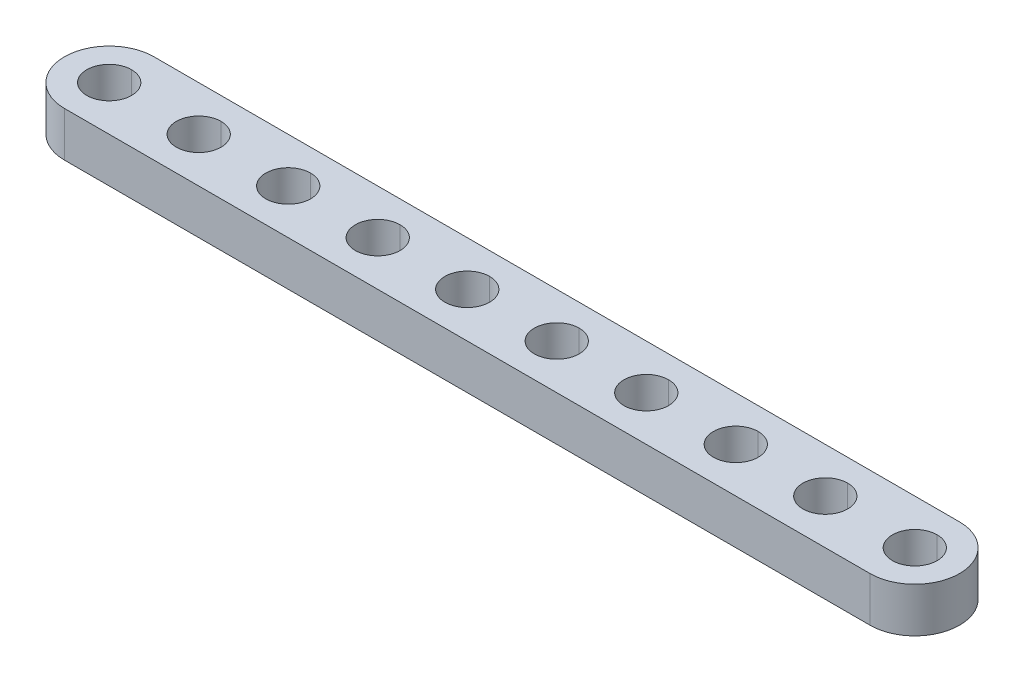
ISO-10303-21;
HEADER;
FILE_DESCRIPTION(('STEP AP214'),'2;1');
FILE_NAME('part.step','',(''),(''),'','','');
FILE_SCHEMA(('AUTOMOTIVE_DESIGN { 1 0 10303 214 1 1 1 1 }'));
ENDSEC;
DATA;
#1=APPLICATION_CONTEXT('core data for automotive mechanical design processes');
#2=APPLICATION_PROTOCOL_DEFINITION('international standard','automotive_design',2000,#1);
#3=PRODUCT_CONTEXT('',#1,'mechanical');
#4=PRODUCT('Part','Part','',(#3));
#5=PRODUCT_RELATED_PRODUCT_CATEGORY('part','',(#4));
#6=PRODUCT_DEFINITION_FORMATION('','',#4);
#7=PRODUCT_DEFINITION_CONTEXT('part definition',#1,'design');
#8=PRODUCT_DEFINITION('design','',#6,#7);
#9=PRODUCT_DEFINITION_SHAPE('','',#8);
#10=(LENGTH_UNIT() NAMED_UNIT(*) SI_UNIT(.MILLI.,.METRE.));
#11=(NAMED_UNIT(*) PLANE_ANGLE_UNIT() SI_UNIT($,.RADIAN.));
#12=(NAMED_UNIT(*) SI_UNIT($,.STERADIAN.) SOLID_ANGLE_UNIT());
#13=UNCERTAINTY_MEASURE_WITH_UNIT(LENGTH_MEASURE(1.E-05),#10,'distance_accuracy_value','');
#14=(GEOMETRIC_REPRESENTATION_CONTEXT(3) GLOBAL_UNCERTAINTY_ASSIGNED_CONTEXT((#13)) GLOBAL_UNIT_ASSIGNED_CONTEXT((#10,
#11,#12)) REPRESENTATION_CONTEXT('',''));
#15=CARTESIAN_POINT('',(0.,0.,0.));
#16=DIRECTION('',(0.,0.,1.));
#17=DIRECTION('',(1.,0.,0.));
#18=AXIS2_PLACEMENT_3D('',#15,#16,#17);
#19=CARTESIAN_POINT('',(36.,4.,0.));
#20=DIRECTION('',(0.,1.,0.));
#21=DIRECTION('',(0.,0.,1.));
#22=AXIS2_PLACEMENT_3D('',#19,#20,#21);
#23=CYLINDRICAL_SURFACE('',#22,2.);
#24=DIRECTION('',(0.,1.,0.));
#25=VECTOR('',#24,1.);
#26=CARTESIAN_POINT('',(36.,4.,-2.));
#27=LINE('',#26,#25);
#28=CARTESIAN_POINT('',(36.,0.,-2.));
#29=VERTEX_POINT('',#28);
#30=CARTESIAN_POINT('',(36.,4.,-2.));
#31=VERTEX_POINT('',#30);
#32=EDGE_CURVE('E172',#29,#31,#27,.T.);
#33=ORIENTED_EDGE('',*,*,#32,.F.);
#34=CARTESIAN_POINT('',(36.,0.,0.));
#35=DIRECTION('',(0.,1.,0.));
#36=DIRECTION('',(0.,0.,1.));
#37=AXIS2_PLACEMENT_3D('',#34,#35,#36);
#38=CIRCLE('',#37,2.);
#39=CARTESIAN_POINT('',(36.,0.,2.));
#40=VERTEX_POINT('',#39);
#41=EDGE_CURVE('E158',#40,#29,#38,.T.);
#42=ORIENTED_EDGE('',*,*,#41,.F.);
#43=DIRECTION('',(0.,1.,0.));
#44=VECTOR('',#43,1.);
#45=CARTESIAN_POINT('',(36.,4.,2.));
#46=LINE('',#45,#44);
#47=CARTESIAN_POINT('',(36.,4.,2.));
#48=VERTEX_POINT('',#47);
#49=EDGE_CURVE('E182',#40,#48,#46,.T.);
#50=ORIENTED_EDGE('',*,*,#49,.T.);
#51=CARTESIAN_POINT('',(36.,4.,0.));
#52=DIRECTION('',(0.,1.,0.));
#53=DIRECTION('',(0.,0.,1.));
#54=AXIS2_PLACEMENT_3D('',#51,#52,#53);
#55=CIRCLE('',#54,2.);
#56=EDGE_CURVE('E174',#48,#31,#55,.T.);
#57=ORIENTED_EDGE('',*,*,#56,.T.);
#58=EDGE_LOOP('',(#33,#42,#50,#57));
#59=FACE_BOUND('',#58,.T.);
#60=ADVANCED_FACE('F15',(#59),#23,.F.);
#61=CARTESIAN_POINT('',(28.,4.,0.));
#62=DIRECTION('',(0.,1.,0.));
#63=DIRECTION('',(0.,0.,1.));
#64=AXIS2_PLACEMENT_3D('',#61,#62,#63);
#65=CYLINDRICAL_SURFACE('',#64,2.);
#66=DIRECTION('',(0.,1.,0.));
#67=VECTOR('',#66,1.);
#68=CARTESIAN_POINT('',(28.,4.,-2.));
#69=LINE('',#68,#67);
#70=CARTESIAN_POINT('',(28.,0.,-2.));
#71=VERTEX_POINT('',#70);
#72=CARTESIAN_POINT('',(28.,4.,-2.));
#73=VERTEX_POINT('',#72);
#74=EDGE_CURVE('E257',#71,#73,#69,.T.);
#75=ORIENTED_EDGE('',*,*,#74,.F.);
#76=CARTESIAN_POINT('',(28.,0.,0.));
#77=DIRECTION('',(0.,1.,0.));
#78=DIRECTION('',(0.,0.,1.));
#79=AXIS2_PLACEMENT_3D('',#76,#77,#78);
#80=CIRCLE('',#79,2.);
#81=CARTESIAN_POINT('',(28.,0.,2.));
#82=VERTEX_POINT('',#81);
#83=EDGE_CURVE('E168',#82,#71,#80,.T.);
#84=ORIENTED_EDGE('',*,*,#83,.F.);
#85=DIRECTION('',(0.,1.,0.));
#86=VECTOR('',#85,1.);
#87=CARTESIAN_POINT('',(28.,4.,2.));
#88=LINE('',#87,#86);
#89=CARTESIAN_POINT('',(28.,4.,2.));
#90=VERTEX_POINT('',#89);
#91=EDGE_CURVE('E350',#82,#90,#88,.T.);
#92=ORIENTED_EDGE('',*,*,#91,.T.);
#93=CARTESIAN_POINT('',(28.,4.,0.));
#94=DIRECTION('',(0.,1.,0.));
#95=DIRECTION('',(0.,0.,1.));
#96=AXIS2_PLACEMENT_3D('',#93,#94,#95);
#97=CIRCLE('',#96,2.);
#98=EDGE_CURVE('E313',#90,#73,#97,.T.);
#99=ORIENTED_EDGE('',*,*,#98,.T.);
#100=EDGE_LOOP('',(#75,#84,#92,#99));
#101=FACE_BOUND('',#100,.T.);
#102=ADVANCED_FACE('F720',(#101),#65,.F.);
#103=CARTESIAN_POINT('',(20.,4.,0.));
#104=DIRECTION('',(0.,1.,0.));
#105=DIRECTION('',(0.,0.,1.));
#106=AXIS2_PLACEMENT_3D('',#103,#104,#105);
#107=CYLINDRICAL_SURFACE('',#106,2.);
#108=DIRECTION('',(0.,1.,0.));
#109=VECTOR('',#108,1.);
#110=CARTESIAN_POINT('',(20.,4.,-2.));
#111=LINE('',#110,#109);
#112=CARTESIAN_POINT('',(20.,0.,-2.));
#113=VERTEX_POINT('',#112);
#114=CARTESIAN_POINT('',(20.,4.,-2.));
#115=VERTEX_POINT('',#114);
#116=EDGE_CURVE('E227',#113,#115,#111,.T.);
#117=ORIENTED_EDGE('',*,*,#116,.F.);
#118=CARTESIAN_POINT('',(20.,0.,0.));
#119=DIRECTION('',(0.,1.,0.));
#120=DIRECTION('',(0.,0.,1.));
#121=AXIS2_PLACEMENT_3D('',#118,#119,#120);
#122=CIRCLE('',#121,2.);
#123=CARTESIAN_POINT('',(20.,0.,2.));
#124=VERTEX_POINT('',#123);
#125=EDGE_CURVE('E274',#124,#113,#122,.T.);
#126=ORIENTED_EDGE('',*,*,#125,.F.);
#127=DIRECTION('',(0.,1.,0.));
#128=VECTOR('',#127,1.);
#129=CARTESIAN_POINT('',(20.,4.,2.));
#130=LINE('',#129,#128);
#131=CARTESIAN_POINT('',(20.,4.,2.));
#132=VERTEX_POINT('',#131);
#133=EDGE_CURVE('E242',#124,#132,#130,.T.);
#134=ORIENTED_EDGE('',*,*,#133,.T.);
#135=CARTESIAN_POINT('',(20.,4.,0.));
#136=DIRECTION('',(0.,1.,0.));
#137=DIRECTION('',(0.,0.,1.));
#138=AXIS2_PLACEMENT_3D('',#135,#136,#137);
#139=CIRCLE('',#138,2.);
#140=EDGE_CURVE('E310',#132,#115,#139,.T.);
#141=ORIENTED_EDGE('',*,*,#140,.T.);
#142=EDGE_LOOP('',(#117,#126,#134,#141));
#143=FACE_BOUND('',#142,.T.);
#144=ADVANCED_FACE('F716',(#143),#107,.F.);
#145=CARTESIAN_POINT('',(12.,4.,0.));
#146=DIRECTION('',(0.,1.,0.));
#147=DIRECTION('',(0.,0.,1.));
#148=AXIS2_PLACEMENT_3D('',#145,#146,#147);
#149=CYLINDRICAL_SURFACE('',#148,2.);
#150=DIRECTION('',(0.,1.,0.));
#151=VECTOR('',#150,1.);
#152=CARTESIAN_POINT('',(12.,4.,-2.));
#153=LINE('',#152,#151);
#154=CARTESIAN_POINT('',(12.,0.,-2.));
#155=VERTEX_POINT('',#154);
#156=CARTESIAN_POINT('',(12.,4.,-2.));
#157=VERTEX_POINT('',#156);
#158=EDGE_CURVE('E233',#155,#157,#153,.T.);
#159=ORIENTED_EDGE('',*,*,#158,.F.);
#160=CARTESIAN_POINT('',(12.,0.,0.));
#161=DIRECTION('',(0.,1.,0.));
#162=DIRECTION('',(0.,0.,1.));
#163=AXIS2_PLACEMENT_3D('',#160,#161,#162);
#164=CIRCLE('',#163,2.);
#165=CARTESIAN_POINT('',(12.,0.,2.));
#166=VERTEX_POINT('',#165);
#167=EDGE_CURVE('E237',#166,#155,#164,.T.);
#168=ORIENTED_EDGE('',*,*,#167,.F.);
#169=DIRECTION('',(0.,1.,0.));
#170=VECTOR('',#169,1.);
#171=CARTESIAN_POINT('',(12.,4.,2.));
#172=LINE('',#171,#170);
#173=CARTESIAN_POINT('',(12.,4.,2.));
#174=VERTEX_POINT('',#173);
#175=EDGE_CURVE('E232',#166,#174,#172,.T.);
#176=ORIENTED_EDGE('',*,*,#175,.T.);
#177=CARTESIAN_POINT('',(12.,4.,0.));
#178=DIRECTION('',(0.,1.,0.));
#179=DIRECTION('',(0.,0.,1.));
#180=AXIS2_PLACEMENT_3D('',#177,#178,#179);
#181=CIRCLE('',#180,2.);
#182=EDGE_CURVE('E303',#174,#157,#181,.T.);
#183=ORIENTED_EDGE('',*,*,#182,.T.);
#184=EDGE_LOOP('',(#159,#168,#176,#183));
#185=FACE_BOUND('',#184,.T.);
#186=ADVANCED_FACE('F704',(#185),#149,.F.);
#187=CARTESIAN_POINT('',(4.,4.,0.));
#188=DIRECTION('',(0.,1.,0.));
#189=DIRECTION('',(0.,0.,1.));
#190=AXIS2_PLACEMENT_3D('',#187,#188,#189);
#191=CYLINDRICAL_SURFACE('',#190,2.);
#192=DIRECTION('',(0.,1.,0.));
#193=VECTOR('',#192,1.);
#194=CARTESIAN_POINT('',(4.,4.,-2.));
#195=LINE('',#194,#193);
#196=CARTESIAN_POINT('',(4.,0.,-2.));
#197=VERTEX_POINT('',#196);
#198=CARTESIAN_POINT('',(4.,4.,-2.));
#199=VERTEX_POINT('',#198);
#200=EDGE_CURVE('E252',#197,#199,#195,.T.);
#201=ORIENTED_EDGE('',*,*,#200,.F.);
#202=CARTESIAN_POINT('',(4.,0.,0.));
#203=DIRECTION('',(0.,1.,0.));
#204=DIRECTION('',(0.,0.,1.));
#205=AXIS2_PLACEMENT_3D('',#202,#203,#204);
#206=CIRCLE('',#205,2.);
#207=CARTESIAN_POINT('',(4.,0.,2.));
#208=VERTEX_POINT('',#207);
#209=EDGE_CURVE('E105',#208,#197,#206,.T.);
#210=ORIENTED_EDGE('',*,*,#209,.F.);
#211=DIRECTION('',(0.,1.,0.));
#212=VECTOR('',#211,1.);
#213=CARTESIAN_POINT('',(4.,4.,2.));
#214=LINE('',#213,#212);
#215=CARTESIAN_POINT('',(4.,4.,2.));
#216=VERTEX_POINT('',#215);
#217=EDGE_CURVE('E251',#208,#216,#214,.T.);
#218=ORIENTED_EDGE('',*,*,#217,.T.);
#219=CARTESIAN_POINT('',(4.,4.,0.));
#220=DIRECTION('',(0.,1.,0.));
#221=DIRECTION('',(0.,0.,1.));
#222=AXIS2_PLACEMENT_3D('',#219,#220,#221);
#223=CIRCLE('',#222,2.);
#224=EDGE_CURVE('E94',#216,#199,#223,.T.);
#225=ORIENTED_EDGE('',*,*,#224,.T.);
#226=EDGE_LOOP('',(#201,#210,#218,#225));
#227=FACE_BOUND('',#226,.T.);
#228=ADVANCED_FACE('F700',(#227),#191,.F.);
#229=CARTESIAN_POINT('',(-4.,4.,0.));
#230=DIRECTION('',(0.,1.,0.));
#231=DIRECTION('',(0.,0.,1.));
#232=AXIS2_PLACEMENT_3D('',#229,#230,#231);
#233=CYLINDRICAL_SURFACE('',#232,2.);
#234=DIRECTION('',(0.,1.,0.));
#235=VECTOR('',#234,1.);
#236=CARTESIAN_POINT('',(-4.,4.,-2.));
#237=LINE('',#236,#235);
#238=CARTESIAN_POINT('',(-4.,0.,-2.));
#239=VERTEX_POINT('',#238);
#240=CARTESIAN_POINT('',(-4.,4.,-2.));
#241=VERTEX_POINT('',#240);
#242=EDGE_CURVE('E324',#239,#241,#237,.T.);
#243=ORIENTED_EDGE('',*,*,#242,.F.);
#244=CARTESIAN_POINT('',(-4.,0.,0.));
#245=DIRECTION('',(0.,1.,0.));
#246=DIRECTION('',(0.,0.,1.));
#247=AXIS2_PLACEMENT_3D('',#244,#245,#246);
#248=CIRCLE('',#247,2.);
#249=CARTESIAN_POINT('',(-4.,0.,2.));
#250=VERTEX_POINT('',#249);
#251=EDGE_CURVE('E236',#250,#239,#248,.T.);
#252=ORIENTED_EDGE('',*,*,#251,.F.);
#253=DIRECTION('',(0.,1.,0.));
#254=VECTOR('',#253,1.);
#255=CARTESIAN_POINT('',(-4.,4.,2.));
#256=LINE('',#255,#254);
#257=CARTESIAN_POINT('',(-4.,4.,2.));
#258=VERTEX_POINT('',#257);
#259=EDGE_CURVE('E263',#250,#258,#256,.T.);
#260=ORIENTED_EDGE('',*,*,#259,.T.);
#261=CARTESIAN_POINT('',(-4.,4.,0.));
#262=DIRECTION('',(0.,1.,0.));
#263=DIRECTION('',(0.,0.,1.));
#264=AXIS2_PLACEMENT_3D('',#261,#262,#263);
#265=CIRCLE('',#264,2.);
#266=EDGE_CURVE('E302',#258,#241,#265,.T.);
#267=ORIENTED_EDGE('',*,*,#266,.T.);
#268=EDGE_LOOP('',(#243,#252,#260,#267));
#269=FACE_BOUND('',#268,.T.);
#270=ADVANCED_FACE('F689',(#269),#233,.F.);
#271=CARTESIAN_POINT('',(-12.,4.,0.));
#272=DIRECTION('',(0.,1.,0.));
#273=DIRECTION('',(0.,0.,1.));
#274=AXIS2_PLACEMENT_3D('',#271,#272,#273);
#275=CYLINDRICAL_SURFACE('',#274,2.);
#276=DIRECTION('',(0.,1.,0.));
#277=VECTOR('',#276,1.);
#278=CARTESIAN_POINT('',(-12.,4.,-2.));
#279=LINE('',#278,#277);
#280=CARTESIAN_POINT('',(-12.,0.,-2.));
#281=VERTEX_POINT('',#280);
#282=CARTESIAN_POINT('',(-12.,4.,-2.));
#283=VERTEX_POINT('',#282);
#284=EDGE_CURVE('E213',#281,#283,#279,.T.);
#285=ORIENTED_EDGE('',*,*,#284,.F.);
#286=CARTESIAN_POINT('',(-12.,0.,0.));
#287=DIRECTION('',(0.,1.,0.));
#288=DIRECTION('',(0.,0.,1.));
#289=AXIS2_PLACEMENT_3D('',#286,#287,#288);
#290=CIRCLE('',#289,2.);
#291=CARTESIAN_POINT('',(-12.,0.,2.));
#292=VERTEX_POINT('',#291);
#293=EDGE_CURVE('E19',#292,#281,#290,.T.);
#294=ORIENTED_EDGE('',*,*,#293,.F.);
#295=DIRECTION('',(0.,1.,0.));
#296=VECTOR('',#295,1.);
#297=CARTESIAN_POINT('',(-12.,4.,2.));
#298=LINE('',#297,#296);
#299=CARTESIAN_POINT('',(-12.,4.,2.));
#300=VERTEX_POINT('',#299);
#301=EDGE_CURVE('E196',#292,#300,#298,.T.);
#302=ORIENTED_EDGE('',*,*,#301,.T.);
#303=CARTESIAN_POINT('',(-12.,4.,0.));
#304=DIRECTION('',(0.,1.,0.));
#305=DIRECTION('',(0.,0.,1.));
#306=AXIS2_PLACEMENT_3D('',#303,#304,#305);
#307=CIRCLE('',#306,2.);
#308=EDGE_CURVE('E354',#300,#283,#307,.T.);
#309=ORIENTED_EDGE('',*,*,#308,.T.);
#310=EDGE_LOOP('',(#285,#294,#302,#309));
#311=FACE_BOUND('',#310,.T.);
#312=ADVANCED_FACE('F685',(#311),#275,.F.);
#313=CARTESIAN_POINT('',(-20.,4.,0.));
#314=DIRECTION('',(0.,1.,0.));
#315=DIRECTION('',(0.,0.,1.));
#316=AXIS2_PLACEMENT_3D('',#313,#314,#315);
#317=CYLINDRICAL_SURFACE('',#316,2.);
#318=DIRECTION('',(0.,1.,0.));
#319=VECTOR('',#318,1.);
#320=CARTESIAN_POINT('',(-20.,4.,-2.));
#321=LINE('',#320,#319);
#322=CARTESIAN_POINT('',(-20.,0.,-2.));
#323=VERTEX_POINT('',#322);
#324=CARTESIAN_POINT('',(-20.,4.,-2.));
#325=VERTEX_POINT('',#324);
#326=EDGE_CURVE('E210',#323,#325,#321,.T.);
#327=ORIENTED_EDGE('',*,*,#326,.F.);
#328=CARTESIAN_POINT('',(-20.,0.,0.));
#329=DIRECTION('',(0.,1.,0.));
#330=DIRECTION('',(0.,0.,1.));
#331=AXIS2_PLACEMENT_3D('',#328,#329,#330);
#332=CIRCLE('',#331,2.);
#333=CARTESIAN_POINT('',(-20.,0.,2.));
#334=VERTEX_POINT('',#333);
#335=EDGE_CURVE('E556',#334,#323,#332,.T.);
#336=ORIENTED_EDGE('',*,*,#335,.F.);
#337=DIRECTION('',(0.,1.,0.));
#338=VECTOR('',#337,1.);
#339=CARTESIAN_POINT('',(-20.,4.,2.));
#340=LINE('',#339,#338);
#341=CARTESIAN_POINT('',(-20.,4.,2.));
#342=VERTEX_POINT('',#341);
#343=EDGE_CURVE('E195',#334,#342,#340,.T.);
#344=ORIENTED_EDGE('',*,*,#343,.T.);
#345=CARTESIAN_POINT('',(-20.,4.,0.));
#346=DIRECTION('',(0.,1.,0.));
#347=DIRECTION('',(0.,0.,1.));
#348=AXIS2_PLACEMENT_3D('',#345,#346,#347);
#349=CIRCLE('',#348,2.);
#350=EDGE_CURVE('E351',#342,#325,#349,.T.);
#351=ORIENTED_EDGE('',*,*,#350,.T.);
#352=EDGE_LOOP('',(#327,#336,#344,#351));
#353=FACE_BOUND('',#352,.T.);
#354=ADVANCED_FACE('F555',(#353),#317,.F.);
#355=CARTESIAN_POINT('',(-28.,4.,0.));
#356=DIRECTION('',(0.,1.,0.));
#357=DIRECTION('',(0.,0.,1.));
#358=AXIS2_PLACEMENT_3D('',#355,#356,#357);
#359=CYLINDRICAL_SURFACE('',#358,2.);
#360=DIRECTION('',(0.,1.,0.));
#361=VECTOR('',#360,1.);
#362=CARTESIAN_POINT('',(-28.,4.,-2.));
#363=LINE('',#362,#361);
#364=CARTESIAN_POINT('',(-28.,0.,-2.));
#365=VERTEX_POINT('',#364);
#366=CARTESIAN_POINT('',(-28.,4.,-2.));
#367=VERTEX_POINT('',#366);
#368=EDGE_CURVE('E194',#365,#367,#363,.T.);
#369=ORIENTED_EDGE('',*,*,#368,.F.);
#370=CARTESIAN_POINT('',(-28.,0.,0.));
#371=DIRECTION('',(0.,1.,0.));
#372=DIRECTION('',(0.,0.,1.));
#373=AXIS2_PLACEMENT_3D('',#370,#371,#372);
#374=CIRCLE('',#373,2.);
#375=CARTESIAN_POINT('',(-28.,0.,2.));
#376=VERTEX_POINT('',#375);
#377=EDGE_CURVE('E26',#376,#365,#374,.T.);
#378=ORIENTED_EDGE('',*,*,#377,.F.);
#379=DIRECTION('',(0.,1.,0.));
#380=VECTOR('',#379,1.);
#381=CARTESIAN_POINT('',(-28.,4.,2.));
#382=LINE('',#381,#380);
#383=CARTESIAN_POINT('',(-28.,4.,2.));
#384=VERTEX_POINT('',#383);
#385=EDGE_CURVE('E369',#376,#384,#382,.T.);
#386=ORIENTED_EDGE('',*,*,#385,.T.);
#387=CARTESIAN_POINT('',(-28.,4.,0.));
#388=DIRECTION('',(0.,1.,0.));
#389=DIRECTION('',(0.,0.,1.));
#390=AXIS2_PLACEMENT_3D('',#387,#388,#389);
#391=CIRCLE('',#390,2.);
#392=EDGE_CURVE('E281',#384,#367,#391,.T.);
#393=ORIENTED_EDGE('',*,*,#392,.T.);
#394=EDGE_LOOP('',(#369,#378,#386,#393));
#395=FACE_BOUND('',#394,.T.);
#396=ADVANCED_FACE('F733',(#395),#359,.F.);
#397=CARTESIAN_POINT('',(-36.,4.,0.));
#398=DIRECTION('',(0.,1.,0.));
#399=DIRECTION('',(0.,0.,1.));
#400=AXIS2_PLACEMENT_3D('',#397,#398,#399);
#401=CYLINDRICAL_SURFACE('',#400,2.);
#402=DIRECTION('',(0.,1.,0.));
#403=VECTOR('',#402,1.);
#404=CARTESIAN_POINT('',(-36.,4.,-2.));
#405=LINE('',#404,#403);
#406=CARTESIAN_POINT('',(-36.,0.,-2.));
#407=VERTEX_POINT('',#406);
#408=CARTESIAN_POINT('',(-36.,4.,-2.));
#409=VERTEX_POINT('',#408);
#410=EDGE_CURVE('E373',#407,#409,#405,.T.);
#411=ORIENTED_EDGE('',*,*,#410,.F.);
#412=CARTESIAN_POINT('',(-36.,0.,0.));
#413=DIRECTION('',(0.,1.,0.));
#414=DIRECTION('',(0.,0.,1.));
#415=AXIS2_PLACEMENT_3D('',#412,#413,#414);
#416=CIRCLE('',#415,2.);
#417=CARTESIAN_POINT('',(-36.,0.,2.));
#418=VERTEX_POINT('',#417);
#419=EDGE_CURVE('E10',#418,#407,#416,.T.);
#420=ORIENTED_EDGE('',*,*,#419,.F.);
#421=DIRECTION('',(0.,1.,0.));
#422=VECTOR('',#421,1.);
#423=CARTESIAN_POINT('',(-36.,4.,2.));
#424=LINE('',#423,#422);
#425=CARTESIAN_POINT('',(-36.,4.,2.));
#426=VERTEX_POINT('',#425);
#427=EDGE_CURVE('E360',#418,#426,#424,.T.);
#428=ORIENTED_EDGE('',*,*,#427,.T.);
#429=CARTESIAN_POINT('',(-36.,4.,0.));
#430=DIRECTION('',(0.,1.,0.));
#431=DIRECTION('',(0.,0.,1.));
#432=AXIS2_PLACEMENT_3D('',#429,#430,#431);
#433=CIRCLE('',#432,2.);
#434=EDGE_CURVE('E169',#426,#409,#433,.T.);
#435=ORIENTED_EDGE('',*,*,#434,.T.);
#436=EDGE_LOOP('',(#411,#420,#428,#435));
#437=FACE_BOUND('',#436,.T.);
#438=ADVANCED_FACE('F737',(#437),#401,.F.);
#439=CARTESIAN_POINT('',(-36.,0.,0.));
#440=DIRECTION('',(0.,1.,0.));
#441=DIRECTION('',(1.,0.,0.));
#442=AXIS2_PLACEMENT_3D('',#439,#440,#441);
#443=PLANE('',#442);
#444=ORIENTED_EDGE('',*,*,#419,.T.);
#445=CARTESIAN_POINT('',(-36.,0.,0.));
#446=DIRECTION('',(0.,1.,0.));
#447=DIRECTION('',(0.,0.,1.));
#448=AXIS2_PLACEMENT_3D('',#445,#446,#447);
#449=CIRCLE('',#448,2.);
#450=EDGE_CURVE('E377',#407,#418,#449,.T.);
#451=ORIENTED_EDGE('',*,*,#450,.T.);
#452=EDGE_LOOP('',(#444,#451));
#453=FACE_BOUND('',#452,.T.);
#454=ORIENTED_EDGE('',*,*,#377,.T.);
#455=CARTESIAN_POINT('',(-28.,0.,0.));
#456=DIRECTION('',(0.,1.,0.));
#457=DIRECTION('',(0.,0.,1.));
#458=AXIS2_PLACEMENT_3D('',#455,#456,#457);
#459=CIRCLE('',#458,2.);
#460=EDGE_CURVE('E192',#365,#376,#459,.T.);
#461=ORIENTED_EDGE('',*,*,#460,.T.);
#462=EDGE_LOOP('',(#454,#461));
#463=FACE_BOUND('',#462,.T.);
#464=ORIENTED_EDGE('',*,*,#335,.T.);
#465=CARTESIAN_POINT('',(-20.,0.,0.));
#466=DIRECTION('',(0.,1.,0.));
#467=DIRECTION('',(0.,0.,1.));
#468=AXIS2_PLACEMENT_3D('',#465,#466,#467);
#469=CIRCLE('',#468,2.);
#470=EDGE_CURVE('E199',#323,#334,#469,.T.);
#471=ORIENTED_EDGE('',*,*,#470,.T.);
#472=EDGE_LOOP('',(#464,#471));
#473=FACE_BOUND('',#472,.T.);
#474=ORIENTED_EDGE('',*,*,#293,.T.);
#475=CARTESIAN_POINT('',(-12.,0.,0.));
#476=DIRECTION('',(0.,1.,0.));
#477=DIRECTION('',(0.,0.,1.));
#478=AXIS2_PLACEMENT_3D('',#475,#476,#477);
#479=CIRCLE('',#478,2.);
#480=EDGE_CURVE('E223',#281,#292,#479,.T.);
#481=ORIENTED_EDGE('',*,*,#480,.T.);
#482=EDGE_LOOP('',(#474,#481));
#483=FACE_BOUND('',#482,.T.);
#484=ORIENTED_EDGE('',*,*,#251,.T.);
#485=CARTESIAN_POINT('',(-4.,0.,0.));
#486=DIRECTION('',(0.,1.,0.));
#487=DIRECTION('',(0.,0.,1.));
#488=AXIS2_PLACEMENT_3D('',#485,#486,#487);
#489=CIRCLE('',#488,2.);
#490=EDGE_CURVE('E328',#239,#250,#489,.T.);
#491=ORIENTED_EDGE('',*,*,#490,.T.);
#492=EDGE_LOOP('',(#484,#491));
#493=FACE_BOUND('',#492,.T.);
#494=ORIENTED_EDGE('',*,*,#209,.T.);
#495=CARTESIAN_POINT('',(4.,0.,0.));
#496=DIRECTION('',(0.,1.,0.));
#497=DIRECTION('',(0.,0.,1.));
#498=AXIS2_PLACEMENT_3D('',#495,#496,#497);
#499=CIRCLE('',#498,2.);
#500=EDGE_CURVE('E294',#197,#208,#499,.T.);
#501=ORIENTED_EDGE('',*,*,#500,.T.);
#502=EDGE_LOOP('',(#494,#501));
#503=FACE_BOUND('',#502,.T.);
#504=ORIENTED_EDGE('',*,*,#167,.T.);
#505=CARTESIAN_POINT('',(12.,0.,0.));
#506=DIRECTION('',(0.,1.,0.));
#507=DIRECTION('',(0.,0.,1.));
#508=AXIS2_PLACEMENT_3D('',#505,#506,#507);
#509=CIRCLE('',#508,2.);
#510=EDGE_CURVE('E243',#155,#166,#509,.T.);
#511=ORIENTED_EDGE('',*,*,#510,.T.);
#512=EDGE_LOOP('',(#504,#511));
#513=FACE_BOUND('',#512,.T.);
#514=ORIENTED_EDGE('',*,*,#125,.T.);
#515=CARTESIAN_POINT('',(20.,0.,0.));
#516=DIRECTION('',(0.,1.,0.));
#517=DIRECTION('',(0.,0.,1.));
#518=AXIS2_PLACEMENT_3D('',#515,#516,#517);
#519=CIRCLE('',#518,2.);
#520=EDGE_CURVE('E359',#113,#124,#519,.T.);
#521=ORIENTED_EDGE('',*,*,#520,.T.);
#522=EDGE_LOOP('',(#514,#521));
#523=FACE_BOUND('',#522,.T.);
#524=ORIENTED_EDGE('',*,*,#83,.T.);
#525=CARTESIAN_POINT('',(28.,0.,0.));
#526=DIRECTION('',(0.,1.,0.));
#527=DIRECTION('',(0.,0.,1.));
#528=AXIS2_PLACEMENT_3D('',#525,#526,#527);
#529=CIRCLE('',#528,2.);
#530=EDGE_CURVE('E262',#71,#82,#529,.T.);
#531=ORIENTED_EDGE('',*,*,#530,.T.);
#532=EDGE_LOOP('',(#524,#531));
#533=FACE_BOUND('',#532,.T.);
#534=ORIENTED_EDGE('',*,*,#41,.T.);
#535=CARTESIAN_POINT('',(36.,0.,0.));
#536=DIRECTION('',(0.,1.,0.));
#537=DIRECTION('',(0.,0.,1.));
#538=AXIS2_PLACEMENT_3D('',#535,#536,#537);
#539=CIRCLE('',#538,2.);
#540=EDGE_CURVE('E163',#29,#40,#539,.T.);
#541=ORIENTED_EDGE('',*,*,#540,.T.);
#542=EDGE_LOOP('',(#534,#541));
#543=FACE_BOUND('',#542,.T.);
#544=CARTESIAN_POINT('',(-36.,0.,0.));
#545=DIRECTION('',(0.,1.,0.));
#546=DIRECTION('',(0.,0.,1.));
#547=AXIS2_PLACEMENT_3D('',#544,#545,#546);
#548=CIRCLE('',#547,4.);
#549=CARTESIAN_POINT('',(-36.,0.,-4.));
#550=VERTEX_POINT('',#549);
#551=CARTESIAN_POINT('',(-36.,0.,4.));
#552=VERTEX_POINT('',#551);
#553=EDGE_CURVE('E290',#550,#552,#548,.T.);
#554=ORIENTED_EDGE('',*,*,#553,.F.);
#555=DIRECTION('',(-1.,0.,0.));
#556=VECTOR('',#555,1.);
#557=CARTESIAN_POINT('',(-36.,0.,-4.));
#558=LINE('',#557,#556);
#559=CARTESIAN_POINT('',(36.,0.,-4.));
#560=VERTEX_POINT('',#559);
#561=EDGE_CURVE('E340',#560,#550,#558,.T.);
#562=ORIENTED_EDGE('',*,*,#561,.F.);
#563=CARTESIAN_POINT('',(36.,0.,0.));
#564=DIRECTION('',(0.,1.,0.));
#565=DIRECTION('',(0.,0.,1.));
#566=AXIS2_PLACEMENT_3D('',#563,#564,#565);
#567=CIRCLE('',#566,4.);
#568=CARTESIAN_POINT('',(36.,0.,4.));
#569=VERTEX_POINT('',#568);
#570=EDGE_CURVE('E268',#569,#560,#567,.T.);
#571=ORIENTED_EDGE('',*,*,#570,.F.);
#572=DIRECTION('',(1.,0.,0.));
#573=VECTOR('',#572,1.);
#574=CARTESIAN_POINT('',(-36.,0.,4.));
#575=LINE('',#574,#573);
#576=EDGE_CURVE('E309',#552,#569,#575,.T.);
#577=ORIENTED_EDGE('',*,*,#576,.F.);
#578=EDGE_LOOP('',(#554,#562,#571,#577));
#579=FACE_BOUND('',#578,.T.);
#580=ADVANCED_FACE('F160',(#453,#463,#473,#483,#493,#503,#513,#523,#533,#543,#579),#443,.F.);
#581=CARTESIAN_POINT('',(-36.,4.,0.));
#582=DIRECTION('',(0.,1.,0.));
#583=DIRECTION('',(1.,0.,0.));
#584=AXIS2_PLACEMENT_3D('',#581,#582,#583);
#585=PLANE('',#584);
#586=ORIENTED_EDGE('',*,*,#434,.F.);
#587=CARTESIAN_POINT('',(-36.,4.,0.));
#588=DIRECTION('',(0.,1.,0.));
#589=DIRECTION('',(0.,0.,1.));
#590=AXIS2_PLACEMENT_3D('',#587,#588,#589);
#591=CIRCLE('',#590,2.);
#592=EDGE_CURVE('E363',#409,#426,#591,.T.);
#593=ORIENTED_EDGE('',*,*,#592,.F.);
#594=EDGE_LOOP('',(#586,#593));
#595=FACE_BOUND('',#594,.T.);
#596=ORIENTED_EDGE('',*,*,#392,.F.);
#597=CARTESIAN_POINT('',(-28.,4.,0.));
#598=DIRECTION('',(0.,1.,0.));
#599=DIRECTION('',(0.,0.,1.));
#600=AXIS2_PLACEMENT_3D('',#597,#598,#599);
#601=CIRCLE('',#600,2.);
#602=EDGE_CURVE('E365',#367,#384,#601,.T.);
#603=ORIENTED_EDGE('',*,*,#602,.F.);
#604=EDGE_LOOP('',(#596,#603));
#605=FACE_BOUND('',#604,.T.);
#606=ORIENTED_EDGE('',*,*,#350,.F.);
#607=CARTESIAN_POINT('',(-20.,4.,0.));
#608=DIRECTION('',(0.,1.,0.));
#609=DIRECTION('',(0.,0.,1.));
#610=AXIS2_PLACEMENT_3D('',#607,#608,#609);
#611=CIRCLE('',#610,2.);
#612=EDGE_CURVE('E253',#325,#342,#611,.T.);
#613=ORIENTED_EDGE('',*,*,#612,.F.);
#614=EDGE_LOOP('',(#606,#613));
#615=FACE_BOUND('',#614,.T.);
#616=ORIENTED_EDGE('',*,*,#308,.F.);
#617=CARTESIAN_POINT('',(-12.,4.,0.));
#618=DIRECTION('',(0.,1.,0.));
#619=DIRECTION('',(0.,0.,1.));
#620=AXIS2_PLACEMENT_3D('',#617,#618,#619);
#621=CIRCLE('',#620,2.);
#622=EDGE_CURVE('E200',#283,#300,#621,.T.);
#623=ORIENTED_EDGE('',*,*,#622,.F.);
#624=EDGE_LOOP('',(#616,#623));
#625=FACE_BOUND('',#624,.T.);
#626=ORIENTED_EDGE('',*,*,#266,.F.);
#627=CARTESIAN_POINT('',(-4.,4.,0.));
#628=DIRECTION('',(0.,1.,0.));
#629=DIRECTION('',(0.,0.,1.));
#630=AXIS2_PLACEMENT_3D('',#627,#628,#629);
#631=CIRCLE('',#630,2.);
#632=EDGE_CURVE('E267',#241,#258,#631,.T.);
#633=ORIENTED_EDGE('',*,*,#632,.F.);
#634=EDGE_LOOP('',(#626,#633));
#635=FACE_BOUND('',#634,.T.);
#636=ORIENTED_EDGE('',*,*,#224,.F.);
#637=CARTESIAN_POINT('',(4.,4.,0.));
#638=DIRECTION('',(0.,1.,0.));
#639=DIRECTION('',(0.,0.,1.));
#640=AXIS2_PLACEMENT_3D('',#637,#638,#639);
#641=CIRCLE('',#640,2.);
#642=EDGE_CURVE('E247',#199,#216,#641,.T.);
#643=ORIENTED_EDGE('',*,*,#642,.F.);
#644=EDGE_LOOP('',(#636,#643));
#645=FACE_BOUND('',#644,.T.);
#646=ORIENTED_EDGE('',*,*,#182,.F.);
#647=CARTESIAN_POINT('',(12.,4.,0.));
#648=DIRECTION('',(0.,1.,0.));
#649=DIRECTION('',(0.,0.,1.));
#650=AXIS2_PLACEMENT_3D('',#647,#648,#649);
#651=CIRCLE('',#650,2.);
#652=EDGE_CURVE('E229',#157,#174,#651,.T.);
#653=ORIENTED_EDGE('',*,*,#652,.F.);
#654=EDGE_LOOP('',(#646,#653));
#655=FACE_BOUND('',#654,.T.);
#656=ORIENTED_EDGE('',*,*,#140,.F.);
#657=CARTESIAN_POINT('',(20.,4.,0.));
#658=DIRECTION('',(0.,1.,0.));
#659=DIRECTION('',(0.,0.,1.));
#660=AXIS2_PLACEMENT_3D('',#657,#658,#659);
#661=CIRCLE('',#660,2.);
#662=EDGE_CURVE('E238',#115,#132,#661,.T.);
#663=ORIENTED_EDGE('',*,*,#662,.F.);
#664=EDGE_LOOP('',(#656,#663));
#665=FACE_BOUND('',#664,.T.);
#666=ORIENTED_EDGE('',*,*,#98,.F.);
#667=CARTESIAN_POINT('',(28.,4.,0.));
#668=DIRECTION('',(0.,1.,0.));
#669=DIRECTION('',(0.,0.,1.));
#670=AXIS2_PLACEMENT_3D('',#667,#668,#669);
#671=CIRCLE('',#670,2.);
#672=EDGE_CURVE('E261',#73,#90,#671,.T.);
#673=ORIENTED_EDGE('',*,*,#672,.F.);
#674=EDGE_LOOP('',(#666,#673));
#675=FACE_BOUND('',#674,.T.);
#676=ORIENTED_EDGE('',*,*,#56,.F.);
#677=CARTESIAN_POINT('',(36.,4.,0.));
#678=DIRECTION('',(0.,1.,0.));
#679=DIRECTION('',(0.,0.,1.));
#680=AXIS2_PLACEMENT_3D('',#677,#678,#679);
#681=CIRCLE('',#680,2.);
#682=EDGE_CURVE('E179',#31,#48,#681,.T.);
#683=ORIENTED_EDGE('',*,*,#682,.F.);
#684=EDGE_LOOP('',(#676,#683));
#685=FACE_BOUND('',#684,.T.);
#686=CARTESIAN_POINT('',(-36.,4.,0.));
#687=DIRECTION('',(0.,1.,0.));
#688=DIRECTION('',(0.,0.,1.));
#689=AXIS2_PLACEMENT_3D('',#686,#687,#688);
#690=CIRCLE('',#689,4.);
#691=CARTESIAN_POINT('',(-36.,4.,-4.));
#692=VERTEX_POINT('',#691);
#693=CARTESIAN_POINT('',(-36.,4.,4.));
#694=VERTEX_POINT('',#693);
#695=EDGE_CURVE('E289',#692,#694,#690,.T.);
#696=ORIENTED_EDGE('',*,*,#695,.T.);
#697=DIRECTION('',(1.,0.,0.));
#698=VECTOR('',#697,1.);
#699=CARTESIAN_POINT('',(-36.,4.,4.));
#700=LINE('',#699,#698);
#701=CARTESIAN_POINT('',(36.,4.,4.));
#702=VERTEX_POINT('',#701);
#703=EDGE_CURVE('E273',#694,#702,#700,.T.);
#704=ORIENTED_EDGE('',*,*,#703,.T.);
#705=CARTESIAN_POINT('',(36.,4.,0.));
#706=DIRECTION('',(0.,1.,0.));
#707=DIRECTION('',(0.,0.,1.));
#708=AXIS2_PLACEMENT_3D('',#705,#706,#707);
#709=CIRCLE('',#708,4.);
#710=CARTESIAN_POINT('',(36.,4.,-4.));
#711=VERTEX_POINT('',#710);
#712=EDGE_CURVE('E344',#702,#711,#709,.T.);
#713=ORIENTED_EDGE('',*,*,#712,.T.);
#714=DIRECTION('',(-1.,0.,0.));
#715=VECTOR('',#714,1.);
#716=CARTESIAN_POINT('',(-36.,4.,-4.));
#717=LINE('',#716,#715);
#718=EDGE_CURVE('E41',#711,#692,#717,.T.);
#719=ORIENTED_EDGE('',*,*,#718,.T.);
#720=EDGE_LOOP('',(#696,#704,#713,#719));
#721=FACE_BOUND('',#720,.T.);
#722=ADVANCED_FACE('F405',(#595,#605,#615,#625,#635,#645,#655,#665,#675,#685,#721),#585,.T.);
#723=CARTESIAN_POINT('',(-36.,4.,-4.));
#724=DIRECTION('',(0.,0.,1.));
#725=DIRECTION('',(1.,0.,0.));
#726=AXIS2_PLACEMENT_3D('',#723,#724,#725);
#727=PLANE('',#726);
#728=ORIENTED_EDGE('',*,*,#561,.T.);
#729=DIRECTION('',(0.,-1.,0.));
#730=VECTOR('',#729,1.);
#731=CARTESIAN_POINT('',(-36.,4.,-4.));
#732=LINE('',#731,#730);
#733=EDGE_CURVE('E305',#692,#550,#732,.T.);
#734=ORIENTED_EDGE('',*,*,#733,.F.);
#735=ORIENTED_EDGE('',*,*,#718,.F.);
#736=DIRECTION('',(0.,-1.,0.));
#737=VECTOR('',#736,1.);
#738=CARTESIAN_POINT('',(36.,4.,-4.));
#739=LINE('',#738,#737);
#740=EDGE_CURVE('E272',#711,#560,#739,.T.);
#741=ORIENTED_EDGE('',*,*,#740,.T.);
#742=EDGE_LOOP('',(#728,#734,#735,#741));
#743=FACE_BOUND('',#742,.T.);
#744=ADVANCED_FACE('F477',(#743),#727,.F.);
#745=CARTESIAN_POINT('',(36.,4.,0.));
#746=DIRECTION('',(0.,-1.,0.));
#747=DIRECTION('',(0.,0.,-1.));
#748=AXIS2_PLACEMENT_3D('',#745,#746,#747);
#749=CYLINDRICAL_SURFACE('',#748,4.);
#750=ORIENTED_EDGE('',*,*,#570,.T.);
#751=ORIENTED_EDGE('',*,*,#740,.F.);
#752=ORIENTED_EDGE('',*,*,#712,.F.);
#753=DIRECTION('',(0.,-1.,0.));
#754=VECTOR('',#753,1.);
#755=CARTESIAN_POINT('',(36.,4.,4.));
#756=LINE('',#755,#754);
#757=EDGE_CURVE('E314',#702,#569,#756,.T.);
#758=ORIENTED_EDGE('',*,*,#757,.T.);
#759=EDGE_LOOP('',(#750,#751,#752,#758));
#760=FACE_BOUND('',#759,.T.);
#761=ADVANCED_FACE('F413',(#760),#749,.T.);
#762=CARTESIAN_POINT('',(-36.,4.,4.));
#763=DIRECTION('',(0.,0.,-1.));
#764=DIRECTION('',(0.,-1.,0.));
#765=AXIS2_PLACEMENT_3D('',#762,#763,#764);
#766=PLANE('',#765);
#767=ORIENTED_EDGE('',*,*,#576,.T.);
#768=ORIENTED_EDGE('',*,*,#757,.F.);
#769=ORIENTED_EDGE('',*,*,#703,.F.);
#770=DIRECTION('',(0.,-1.,0.));
#771=VECTOR('',#770,1.);
#772=CARTESIAN_POINT('',(-36.,4.,4.));
#773=LINE('',#772,#771);
#774=EDGE_CURVE('E285',#694,#552,#773,.T.);
#775=ORIENTED_EDGE('',*,*,#774,.T.);
#776=EDGE_LOOP('',(#767,#768,#769,#775));
#777=FACE_BOUND('',#776,.T.);
#778=ADVANCED_FACE('F411',(#777),#766,.F.);
#779=CARTESIAN_POINT('',(-36.,4.,0.));
#780=DIRECTION('',(0.,-1.,0.));
#781=DIRECTION('',(0.,0.,-1.));
#782=AXIS2_PLACEMENT_3D('',#779,#780,#781);
#783=CYLINDRICAL_SURFACE('',#782,4.);
#784=ORIENTED_EDGE('',*,*,#553,.T.);
#785=ORIENTED_EDGE('',*,*,#774,.F.);
#786=ORIENTED_EDGE('',*,*,#695,.F.);
#787=ORIENTED_EDGE('',*,*,#733,.T.);
#788=EDGE_LOOP('',(#784,#785,#786,#787));
#789=FACE_BOUND('',#788,.T.);
#790=ADVANCED_FACE('F480',(#789),#783,.T.);
#791=CARTESIAN_POINT('',(-36.,4.,0.));
#792=DIRECTION('',(0.,1.,0.));
#793=DIRECTION('',(0.,0.,1.));
#794=AXIS2_PLACEMENT_3D('',#791,#792,#793);
#795=CYLINDRICAL_SURFACE('',#794,2.);
#796=ORIENTED_EDGE('',*,*,#450,.F.);
#797=ORIENTED_EDGE('',*,*,#410,.T.);
#798=ORIENTED_EDGE('',*,*,#592,.T.);
#799=ORIENTED_EDGE('',*,*,#427,.F.);
#800=EDGE_LOOP('',(#796,#797,#798,#799));
#801=FACE_BOUND('',#800,.T.);
#802=ADVANCED_FACE('F765',(#801),#795,.F.);
#803=CARTESIAN_POINT('',(-28.,4.,0.));
#804=DIRECTION('',(0.,1.,0.));
#805=DIRECTION('',(0.,0.,1.));
#806=AXIS2_PLACEMENT_3D('',#803,#804,#805);
#807=CYLINDRICAL_SURFACE('',#806,2.);
#808=ORIENTED_EDGE('',*,*,#460,.F.);
#809=ORIENTED_EDGE('',*,*,#368,.T.);
#810=ORIENTED_EDGE('',*,*,#602,.T.);
#811=ORIENTED_EDGE('',*,*,#385,.F.);
#812=EDGE_LOOP('',(#808,#809,#810,#811));
#813=FACE_BOUND('',#812,.T.);
#814=ADVANCED_FACE('F761',(#813),#807,.F.);
#815=CARTESIAN_POINT('',(-20.,4.,0.));
#816=DIRECTION('',(0.,1.,0.));
#817=DIRECTION('',(0.,0.,1.));
#818=AXIS2_PLACEMENT_3D('',#815,#816,#817);
#819=CYLINDRICAL_SURFACE('',#818,2.);
#820=ORIENTED_EDGE('',*,*,#470,.F.);
#821=ORIENTED_EDGE('',*,*,#326,.T.);
#822=ORIENTED_EDGE('',*,*,#612,.T.);
#823=ORIENTED_EDGE('',*,*,#343,.F.);
#824=EDGE_LOOP('',(#820,#821,#822,#823));
#825=FACE_BOUND('',#824,.T.);
#826=ADVANCED_FACE('F559',(#825),#819,.F.);
#827=CARTESIAN_POINT('',(-12.,4.,0.));
#828=DIRECTION('',(0.,1.,0.));
#829=DIRECTION('',(0.,0.,1.));
#830=AXIS2_PLACEMENT_3D('',#827,#828,#829);
#831=CYLINDRICAL_SURFACE('',#830,2.);
#832=ORIENTED_EDGE('',*,*,#480,.F.);
#833=ORIENTED_EDGE('',*,*,#284,.T.);
#834=ORIENTED_EDGE('',*,*,#622,.T.);
#835=ORIENTED_EDGE('',*,*,#301,.F.);
#836=EDGE_LOOP('',(#832,#833,#834,#835));
#837=FACE_BOUND('',#836,.T.);
#838=ADVANCED_FACE('F680',(#837),#831,.F.);
#839=CARTESIAN_POINT('',(-4.,4.,0.));
#840=DIRECTION('',(0.,1.,0.));
#841=DIRECTION('',(0.,0.,1.));
#842=AXIS2_PLACEMENT_3D('',#839,#840,#841);
#843=CYLINDRICAL_SURFACE('',#842,2.);
#844=ORIENTED_EDGE('',*,*,#490,.F.);
#845=ORIENTED_EDGE('',*,*,#242,.T.);
#846=ORIENTED_EDGE('',*,*,#632,.T.);
#847=ORIENTED_EDGE('',*,*,#259,.F.);
#848=EDGE_LOOP('',(#844,#845,#846,#847));
#849=FACE_BOUND('',#848,.T.);
#850=ADVANCED_FACE('F17',(#849),#843,.F.);
#851=CARTESIAN_POINT('',(4.,4.,0.));
#852=DIRECTION('',(0.,1.,0.));
#853=DIRECTION('',(0.,0.,1.));
#854=AXIS2_PLACEMENT_3D('',#851,#852,#853);
#855=CYLINDRICAL_SURFACE('',#854,2.);
#856=ORIENTED_EDGE('',*,*,#500,.F.);
#857=ORIENTED_EDGE('',*,*,#200,.T.);
#858=ORIENTED_EDGE('',*,*,#642,.T.);
#859=ORIENTED_EDGE('',*,*,#217,.F.);
#860=EDGE_LOOP('',(#856,#857,#858,#859));
#861=FACE_BOUND('',#860,.T.);
#862=ADVANCED_FACE('F679',(#861),#855,.F.);
#863=CARTESIAN_POINT('',(12.,4.,0.));
#864=DIRECTION('',(0.,1.,0.));
#865=DIRECTION('',(0.,0.,1.));
#866=AXIS2_PLACEMENT_3D('',#863,#864,#865);
#867=CYLINDRICAL_SURFACE('',#866,2.);
#868=ORIENTED_EDGE('',*,*,#510,.F.);
#869=ORIENTED_EDGE('',*,*,#158,.T.);
#870=ORIENTED_EDGE('',*,*,#652,.T.);
#871=ORIENTED_EDGE('',*,*,#175,.F.);
#872=EDGE_LOOP('',(#868,#869,#870,#871));
#873=FACE_BOUND('',#872,.T.);
#874=ADVANCED_FACE('F743',(#873),#867,.F.);
#875=CARTESIAN_POINT('',(20.,4.,0.));
#876=DIRECTION('',(0.,1.,0.));
#877=DIRECTION('',(0.,0.,1.));
#878=AXIS2_PLACEMENT_3D('',#875,#876,#877);
#879=CYLINDRICAL_SURFACE('',#878,2.);
#880=ORIENTED_EDGE('',*,*,#520,.F.);
#881=ORIENTED_EDGE('',*,*,#116,.T.);
#882=ORIENTED_EDGE('',*,*,#662,.T.);
#883=ORIENTED_EDGE('',*,*,#133,.F.);
#884=EDGE_LOOP('',(#880,#881,#882,#883));
#885=FACE_BOUND('',#884,.T.);
#886=ADVANCED_FACE('F747',(#885),#879,.F.);
#887=CARTESIAN_POINT('',(28.,4.,0.));
#888=DIRECTION('',(0.,1.,0.));
#889=DIRECTION('',(0.,0.,1.));
#890=AXIS2_PLACEMENT_3D('',#887,#888,#889);
#891=CYLINDRICAL_SURFACE('',#890,2.);
#892=ORIENTED_EDGE('',*,*,#530,.F.);
#893=ORIENTED_EDGE('',*,*,#74,.T.);
#894=ORIENTED_EDGE('',*,*,#672,.T.);
#895=ORIENTED_EDGE('',*,*,#91,.F.);
#896=EDGE_LOOP('',(#892,#893,#894,#895));
#897=FACE_BOUND('',#896,.T.);
#898=ADVANCED_FACE('F756',(#897),#891,.F.);
#899=CARTESIAN_POINT('',(36.,4.,0.));
#900=DIRECTION('',(0.,1.,0.));
#901=DIRECTION('',(0.,0.,1.));
#902=AXIS2_PLACEMENT_3D('',#899,#900,#901);
#903=CYLINDRICAL_SURFACE('',#902,2.);
#904=ORIENTED_EDGE('',*,*,#540,.F.);
#905=ORIENTED_EDGE('',*,*,#32,.T.);
#906=ORIENTED_EDGE('',*,*,#682,.T.);
#907=ORIENTED_EDGE('',*,*,#49,.F.);
#908=EDGE_LOOP('',(#904,#905,#906,#907));
#909=FACE_BOUND('',#908,.T.);
#910=ADVANCED_FACE('F181',(#909),#903,.F.);
#911=CLOSED_SHELL('',(#60,#102,#144,#186,#228,#270,#312,#354,#396,#438,#580,#722,#744,#761,#778,
#790,#802,#814,#826,#838,#850,#862,#874,#886,#898,#910));
#912=MANIFOLD_SOLID_BREP('B1',#911);
#913=ADVANCED_BREP_SHAPE_REPRESENTATION('',(#18,#912),#14);
#914=SHAPE_DEFINITION_REPRESENTATION(#9,#913);
ENDSEC;
END-ISO-10303-21;
